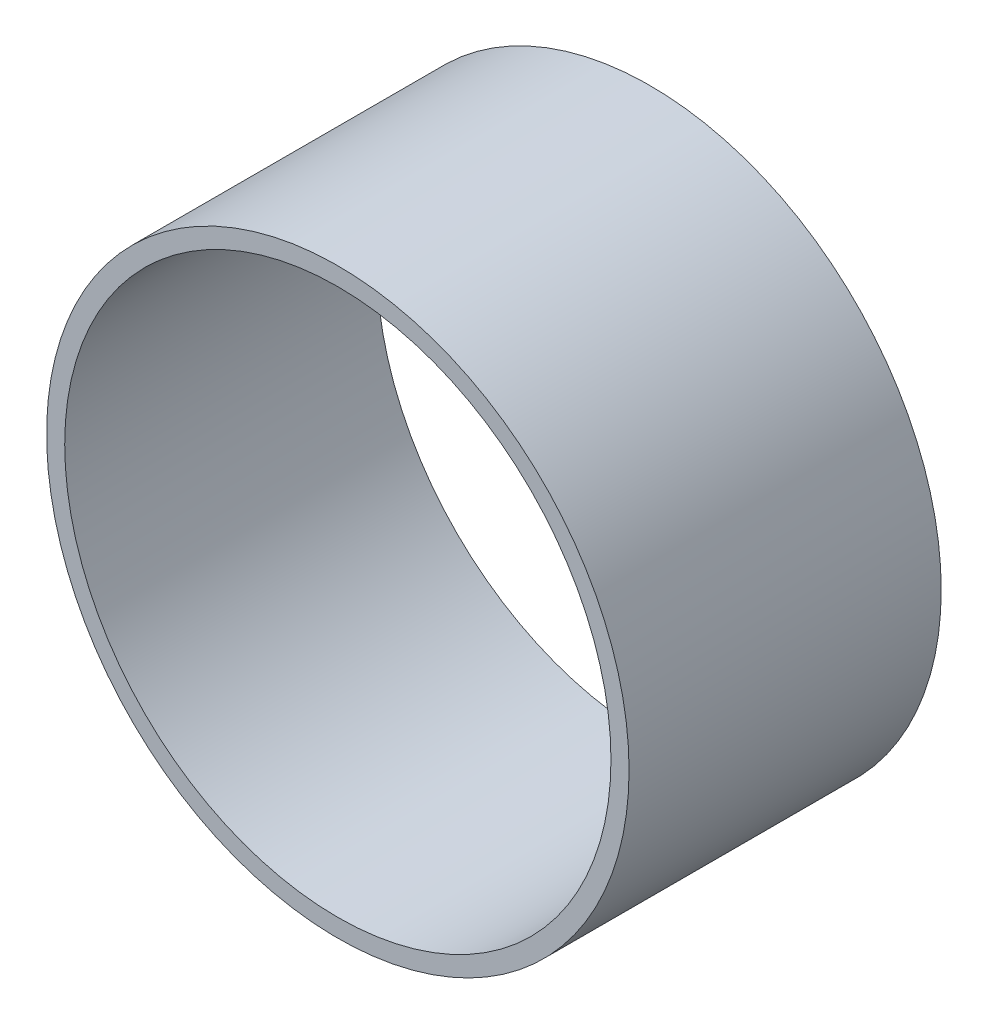
ISO-10303-21;
HEADER;
FILE_DESCRIPTION(('STEP AP214'),'2;1');
FILE_NAME('part.step','',(''),(''),'','','');
FILE_SCHEMA(('AUTOMOTIVE_DESIGN { 1 0 10303 214 1 1 1 1 }'));
ENDSEC;
DATA;
#1=APPLICATION_CONTEXT('core data for automotive mechanical design processes');
#2=APPLICATION_PROTOCOL_DEFINITION('international standard','automotive_design',2000,#1);
#3=PRODUCT_CONTEXT('',#1,'mechanical');
#4=PRODUCT('Part','Part','',(#3));
#5=PRODUCT_RELATED_PRODUCT_CATEGORY('part','',(#4));
#6=PRODUCT_DEFINITION_FORMATION('','',#4);
#7=PRODUCT_DEFINITION_CONTEXT('part definition',#1,'design');
#8=PRODUCT_DEFINITION('design','',#6,#7);
#9=PRODUCT_DEFINITION_SHAPE('','',#8);
#10=(LENGTH_UNIT() NAMED_UNIT(*) SI_UNIT(.MILLI.,.METRE.));
#11=(NAMED_UNIT(*) PLANE_ANGLE_UNIT() SI_UNIT($,.RADIAN.));
#12=(NAMED_UNIT(*) SI_UNIT($,.STERADIAN.) SOLID_ANGLE_UNIT());
#13=UNCERTAINTY_MEASURE_WITH_UNIT(LENGTH_MEASURE(1.E-05),#10,'distance_accuracy_value','');
#14=(GEOMETRIC_REPRESENTATION_CONTEXT(3) GLOBAL_UNCERTAINTY_ASSIGNED_CONTEXT((#13)) GLOBAL_UNIT_ASSIGNED_CONTEXT((#10,
#11,#12)) REPRESENTATION_CONTEXT('',''));
#15=CARTESIAN_POINT('',(0.,0.,0.));
#16=DIRECTION('',(0.,0.,1.));
#17=DIRECTION('',(1.,0.,0.));
#18=AXIS2_PLACEMENT_3D('',#15,#16,#17);
#19=CARTESIAN_POINT('',(0.,0.,25.4));
#20=DIRECTION('',(0.,0.,1.));
#21=DIRECTION('',(1.,0.,0.));
#22=AXIS2_PLACEMENT_3D('',#19,#20,#21);
#23=PLANE('',#22);
#24=CARTESIAN_POINT('',(0.,0.,25.4));
#25=DIRECTION('',(0.,0.,1.));
#26=DIRECTION('',(1.,0.,0.));
#27=AXIS2_PLACEMENT_3D('',#24,#25,#26);
#28=CIRCLE('',#27,23.6982);
#29=CARTESIAN_POINT('',(23.6982,0.,25.4));
#30=VERTEX_POINT('',#29);
#31=EDGE_CURVE('E10',#30,#30,#28,.T.);
#32=ORIENTED_EDGE('',*,*,#31,.T.);
#33=EDGE_LOOP('',(#32));
#34=FACE_BOUND('',#33,.T.);
#35=CARTESIAN_POINT('',(0.,0.,25.4));
#36=DIRECTION('',(0.,0.,1.));
#37=DIRECTION('',(1.,0.,0.));
#38=AXIS2_PLACEMENT_3D('',#35,#36,#37);
#39=CIRCLE('',#38,22.225);
#40=CARTESIAN_POINT('',(22.225,0.,25.4));
#41=VERTEX_POINT('',#40);
#42=EDGE_CURVE('E42',#41,#41,#39,.T.);
#43=ORIENTED_EDGE('',*,*,#42,.F.);
#44=EDGE_LOOP('',(#43));
#45=FACE_BOUND('',#44,.T.);
#46=ADVANCED_FACE('F31',(#34,#45),#23,.T.);
#47=CARTESIAN_POINT('',(0.,0.,0.));
#48=DIRECTION('',(0.,0.,1.));
#49=DIRECTION('',(1.,0.,0.));
#50=AXIS2_PLACEMENT_3D('',#47,#48,#49);
#51=PLANE('',#50);
#52=CARTESIAN_POINT('',(0.,0.,0.));
#53=DIRECTION('',(0.,0.,1.));
#54=DIRECTION('',(1.,0.,0.));
#55=AXIS2_PLACEMENT_3D('',#52,#53,#54);
#56=CIRCLE('',#55,23.6982);
#57=CARTESIAN_POINT('',(23.6982,0.,0.));
#58=VERTEX_POINT('',#57);
#59=EDGE_CURVE('E35',#58,#58,#56,.T.);
#60=ORIENTED_EDGE('',*,*,#59,.F.);
#61=EDGE_LOOP('',(#60));
#62=FACE_BOUND('',#61,.T.);
#63=CARTESIAN_POINT('',(0.,0.,0.));
#64=DIRECTION('',(0.,0.,1.));
#65=DIRECTION('',(1.,0.,0.));
#66=AXIS2_PLACEMENT_3D('',#63,#64,#65);
#67=CIRCLE('',#66,22.225);
#68=CARTESIAN_POINT('',(22.225,0.,0.));
#69=VERTEX_POINT('',#68);
#70=EDGE_CURVE('E44',#69,#69,#67,.T.);
#71=ORIENTED_EDGE('',*,*,#70,.T.);
#72=EDGE_LOOP('',(#71));
#73=FACE_BOUND('',#72,.T.);
#74=ADVANCED_FACE('F54',(#62,#73),#51,.F.);
#75=CARTESIAN_POINT('',(0.,0.,25.4));
#76=DIRECTION('',(0.,0.,-1.));
#77=DIRECTION('',(-1.,0.,0.));
#78=AXIS2_PLACEMENT_3D('',#75,#76,#77);
#79=CYLINDRICAL_SURFACE('',#78,23.6982);
#80=ORIENTED_EDGE('',*,*,#31,.F.);
#81=EDGE_LOOP('',(#80));
#82=FACE_BOUND('',#81,.T.);
#83=ORIENTED_EDGE('',*,*,#59,.T.);
#84=EDGE_LOOP('',(#83));
#85=FACE_BOUND('',#84,.T.);
#86=ADVANCED_FACE('F33',(#82,#85),#79,.T.);
#87=CARTESIAN_POINT('',(0.,0.,25.4));
#88=DIRECTION('',(0.,0.,-1.));
#89=DIRECTION('',(-1.,0.,0.));
#90=AXIS2_PLACEMENT_3D('',#87,#88,#89);
#91=CYLINDRICAL_SURFACE('',#90,22.225);
#92=ORIENTED_EDGE('',*,*,#42,.T.);
#93=EDGE_LOOP('',(#92));
#94=FACE_BOUND('',#93,.T.);
#95=ORIENTED_EDGE('',*,*,#70,.F.);
#96=EDGE_LOOP('',(#95));
#97=FACE_BOUND('',#96,.T.);
#98=ADVANCED_FACE('F50',(#94,#97),#91,.F.);
#99=CLOSED_SHELL('',(#46,#74,#86,#98));
#100=MANIFOLD_SOLID_BREP('B2',#99);
#101=ADVANCED_BREP_SHAPE_REPRESENTATION('',(#18,#100),#14);
#102=SHAPE_DEFINITION_REPRESENTATION(#9,#101);
ENDSEC;
END-ISO-10303-21;
